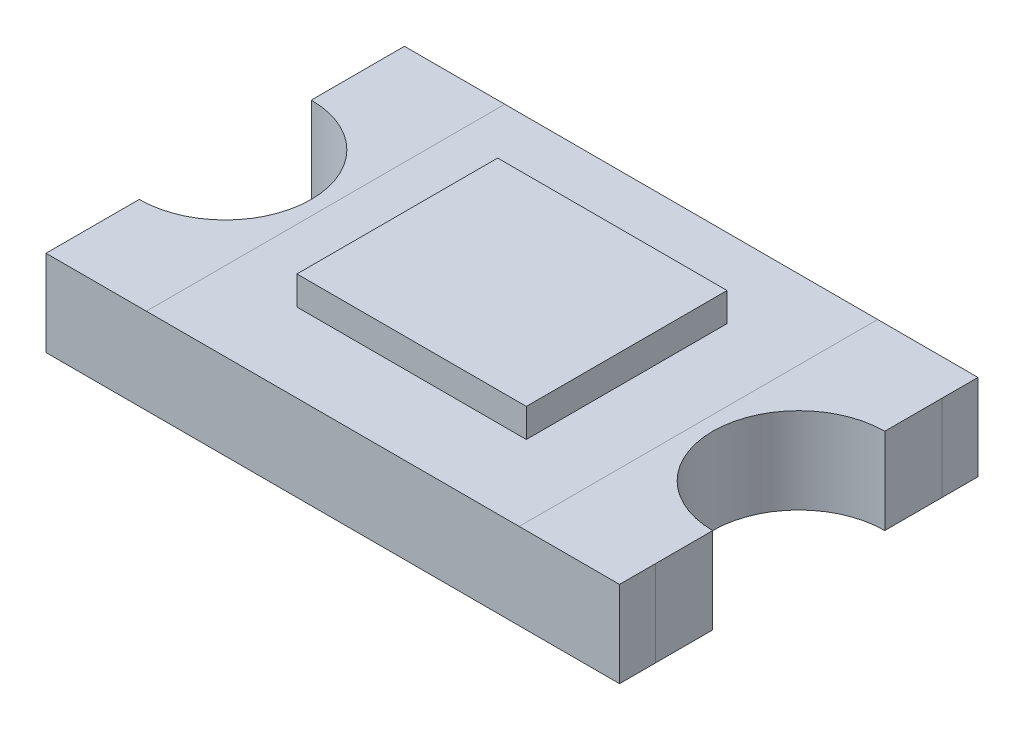
ISO-10303-21;
HEADER;
FILE_DESCRIPTION(('STEP AP214'),'2;1');
FILE_NAME('part.step','',(''),(''),'','','');
FILE_SCHEMA(('AUTOMOTIVE_DESIGN { 1 0 10303 214 1 1 1 1 }'));
ENDSEC;
DATA;
#1=APPLICATION_CONTEXT('core data for automotive mechanical design processes');
#2=APPLICATION_PROTOCOL_DEFINITION('international standard','automotive_design',2000,#1);
#3=PRODUCT_CONTEXT('',#1,'mechanical');
#4=PRODUCT('Part','Part','',(#3));
#5=PRODUCT_RELATED_PRODUCT_CATEGORY('part','',(#4));
#6=PRODUCT_DEFINITION_FORMATION('','',#4);
#7=PRODUCT_DEFINITION_CONTEXT('part definition',#1,'design');
#8=PRODUCT_DEFINITION('design','',#6,#7);
#9=PRODUCT_DEFINITION_SHAPE('','',#8);
#10=(LENGTH_UNIT() NAMED_UNIT(*) SI_UNIT(.MILLI.,.METRE.));
#11=(NAMED_UNIT(*) PLANE_ANGLE_UNIT() SI_UNIT($,.RADIAN.));
#12=(NAMED_UNIT(*) SI_UNIT($,.STERADIAN.) SOLID_ANGLE_UNIT());
#13=UNCERTAINTY_MEASURE_WITH_UNIT(LENGTH_MEASURE(1.E-05),#10,'distance_accuracy_value','');
#14=(GEOMETRIC_REPRESENTATION_CONTEXT(3) GLOBAL_UNCERTAINTY_ASSIGNED_CONTEXT((#13)) GLOBAL_UNIT_ASSIGNED_CONTEXT((#10,
#11,#12)) REPRESENTATION_CONTEXT('',''));
#15=CARTESIAN_POINT('',(0.,0.,0.));
#16=DIRECTION('',(0.,0.,1.));
#17=DIRECTION('',(1.,0.,0.));
#18=AXIS2_PLACEMENT_3D('',#15,#16,#17);
#19=CARTESIAN_POINT('',(1.,0.,0.));
#20=DIRECTION('',(0.,1.,0.));
#21=DIRECTION('',(1.,0.,0.));
#22=AXIS2_PLACEMENT_3D('',#19,#20,#21);
#23=PLANE('',#22);
#24=DIRECTION('',(0.,0.,1.));
#25=VECTOR('',#24,1.);
#26=CARTESIAN_POINT('',(-1.,0.,-0.3));
#27=LINE('',#26,#25);
#28=CARTESIAN_POINT('',(-1.,0.,-0.575));
#29=VERTEX_POINT('',#28);
#30=CARTESIAN_POINT('',(-1.,0.,-0.5));
#31=VERTEX_POINT('',#30);
#32=EDGE_CURVE('P0_E342',#29,#31,#27,.T.);
#33=ORIENTED_EDGE('',*,*,#32,.F.);
#34=DIRECTION('',(1.,0.,0.));
#35=VECTOR('',#34,1.);
#36=CARTESIAN_POINT('',(1.,0.,-0.575));
#37=LINE('',#36,#35);
#38=CARTESIAN_POINT('',(-0.6,0.,-0.575));
#39=VERTEX_POINT('',#38);
#40=EDGE_CURVE('P0_E319',#29,#39,#37,.T.);
#41=ORIENTED_EDGE('',*,*,#40,.T.);
#42=DIRECTION('',(0.,0.,1.));
#43=VECTOR('',#42,1.);
#44=CARTESIAN_POINT('',(-0.6,0.,0.));
#45=LINE('',#44,#43);
#46=CARTESIAN_POINT('',(-0.6,0.,0.575));
#47=VERTEX_POINT('',#46);
#48=EDGE_CURVE('P0_E311',#39,#47,#45,.T.);
#49=ORIENTED_EDGE('',*,*,#48,.T.);
#50=DIRECTION('',(-1.,0.,0.));
#51=VECTOR('',#50,1.);
#52=CARTESIAN_POINT('',(1.,0.,0.575));
#53=LINE('',#52,#51);
#54=CARTESIAN_POINT('',(-1.,0.,0.575));
#55=VERTEX_POINT('',#54);
#56=EDGE_CURVE('P0_E227',#47,#55,#53,.T.);
#57=ORIENTED_EDGE('',*,*,#56,.T.);
#58=DIRECTION('',(0.,0.,1.));
#59=VECTOR('',#58,1.);
#60=CARTESIAN_POINT('',(-1.,0.,0.625));
#61=LINE('',#60,#59);
#62=CARTESIAN_POINT('',(-1.,0.,0.5));
#63=VERTEX_POINT('',#62);
#64=EDGE_CURVE('P0_E243',#63,#55,#61,.T.);
#65=ORIENTED_EDGE('',*,*,#64,.F.);
#66=DIRECTION('',(0.,0.,1.));
#67=VECTOR('',#66,1.);
#68=CARTESIAN_POINT('',(-1.,0.,0.625));
#69=LINE('',#68,#67);
#70=CARTESIAN_POINT('',(-1.,0.,0.3));
#71=VERTEX_POINT('',#70);
#72=EDGE_CURVE('P0_E46',#71,#63,#69,.T.);
#73=ORIENTED_EDGE('',*,*,#72,.F.);
#74=CARTESIAN_POINT('',(-1.,0.,0.));
#75=DIRECTION('',(0.,-1.,0.));
#76=DIRECTION('',(0.,0.,1.));
#77=AXIS2_PLACEMENT_3D('',#74,#75,#76);
#78=CIRCLE('',#77,0.3);
#79=CARTESIAN_POINT('',(-1.,0.,-0.3));
#80=VERTEX_POINT('',#79);
#81=EDGE_CURVE('P0_E381',#80,#71,#78,.T.);
#82=ORIENTED_EDGE('',*,*,#81,.F.);
#83=DIRECTION('',(0.,0.,1.));
#84=VECTOR('',#83,1.);
#85=CARTESIAN_POINT('',(-1.,0.,-0.3));
#86=LINE('',#85,#84);
#87=EDGE_CURVE('P0_E440',#31,#80,#86,.T.);
#88=ORIENTED_EDGE('',*,*,#87,.F.);
#89=EDGE_LOOP('',(#33,#41,#49,#57,#65,#73,#82,#88));
#90=FACE_BOUND('',#89,.T.);
#91=ADVANCED_FACE('P0_F17',(#90),#23,.F.);
#92=CARTESIAN_POINT('',(1.,0.3,0.));
#93=DIRECTION('',(0.,1.,0.));
#94=DIRECTION('',(1.,0.,0.));
#95=AXIS2_PLACEMENT_3D('',#92,#93,#94);
#96=PLANE('',#95);
#97=DIRECTION('',(0.,0.,-1.));
#98=VECTOR('',#97,1.);
#99=CARTESIAN_POINT('',(0.65,0.3,0.));
#100=LINE('',#99,#98);
#101=CARTESIAN_POINT('',(0.65,0.3,0.625));
#102=VERTEX_POINT('',#101);
#103=CARTESIAN_POINT('',(0.65,0.3,-0.625));
#104=VERTEX_POINT('',#103);
#105=EDGE_CURVE('P0_E277',#102,#104,#100,.T.);
#106=ORIENTED_EDGE('',*,*,#105,.F.);
#107=DIRECTION('',(1.,0.,0.));
#108=VECTOR('',#107,1.);
#109=CARTESIAN_POINT('',(-1.,0.3,0.625));
#110=LINE('',#109,#108);
#111=CARTESIAN_POINT('',(1.,0.3,0.625));
#112=VERTEX_POINT('',#111);
#113=EDGE_CURVE('P0_E372',#102,#112,#110,.T.);
#114=ORIENTED_EDGE('',*,*,#113,.T.);
#115=DIRECTION('',(0.,0.,-1.));
#116=VECTOR('',#115,1.);
#117=CARTESIAN_POINT('',(1.,0.3,0.625));
#118=LINE('',#117,#116);
#119=CARTESIAN_POINT('',(1.,0.3,0.5));
#120=VERTEX_POINT('',#119);
#121=EDGE_CURVE('P0_E260',#112,#120,#118,.T.);
#122=ORIENTED_EDGE('',*,*,#121,.T.);
#123=DIRECTION('',(0.,0.,-1.));
#124=VECTOR('',#123,1.);
#125=CARTESIAN_POINT('',(1.,0.3,0.625));
#126=LINE('',#125,#124);
#127=CARTESIAN_POINT('',(1.,0.3,0.3));
#128=VERTEX_POINT('',#127);
#129=EDGE_CURVE('P0_E289',#120,#128,#126,.T.);
#130=ORIENTED_EDGE('',*,*,#129,.T.);
#131=CARTESIAN_POINT('',(1.,0.3,0.));
#132=DIRECTION('',(0.,-1.,0.));
#133=DIRECTION('',(0.,0.,1.));
#134=AXIS2_PLACEMENT_3D('',#131,#132,#133);
#135=CIRCLE('',#134,0.3);
#136=CARTESIAN_POINT('',(1.,0.3,-0.3));
#137=VERTEX_POINT('',#136);
#138=EDGE_CURVE('P0_E25',#128,#137,#135,.T.);
#139=ORIENTED_EDGE('',*,*,#138,.T.);
#140=DIRECTION('',(0.,0.,-1.));
#141=VECTOR('',#140,1.);
#142=CARTESIAN_POINT('',(1.,0.3,-0.3));
#143=LINE('',#142,#141);
#144=CARTESIAN_POINT('',(1.,0.3,-0.5));
#145=VERTEX_POINT('',#144);
#146=EDGE_CURVE('P0_E397',#137,#145,#143,.T.);
#147=ORIENTED_EDGE('',*,*,#146,.T.);
#148=DIRECTION('',(0.,0.,-1.));
#149=VECTOR('',#148,1.);
#150=CARTESIAN_POINT('',(1.,0.3,-0.3));
#151=LINE('',#150,#149);
#152=CARTESIAN_POINT('',(1.,0.3,-0.625));
#153=VERTEX_POINT('',#152);
#154=EDGE_CURVE('P0_E11',#145,#153,#151,.T.);
#155=ORIENTED_EDGE('',*,*,#154,.T.);
#156=DIRECTION('',(-1.,0.,0.));
#157=VECTOR('',#156,1.);
#158=CARTESIAN_POINT('',(-1.,0.3,-0.625));
#159=LINE('',#158,#157);
#160=EDGE_CURVE('P0_E343',#153,#104,#159,.T.);
#161=ORIENTED_EDGE('',*,*,#160,.T.);
#162=EDGE_LOOP('',(#106,#114,#122,#130,#139,#147,#155,#161));
#163=FACE_BOUND('',#162,.T.);
#164=ADVANCED_FACE('P0_F395',(#163),#96,.T.);
#165=CARTESIAN_POINT('',(1.,0.3,-0.3));
#166=DIRECTION('',(-1.,0.,0.));
#167=DIRECTION('',(0.,0.,1.));
#168=AXIS2_PLACEMENT_3D('',#165,#166,#167);
#169=PLANE('',#168);
#170=ORIENTED_EDGE('',*,*,#154,.F.);
#171=DIRECTION('',(0.,-1.,0.));
#172=VECTOR('',#171,1.);
#173=CARTESIAN_POINT('',(1.,0.3,-0.5));
#174=LINE('',#173,#172);
#175=CARTESIAN_POINT('',(1.,0.,-0.5));
#176=VERTEX_POINT('',#175);
#177=EDGE_CURVE('P0_E411',#145,#176,#174,.T.);
#178=ORIENTED_EDGE('',*,*,#177,.T.);
#179=DIRECTION('',(0.,0.,-1.));
#180=VECTOR('',#179,1.);
#181=CARTESIAN_POINT('',(1.,0.,-0.3));
#182=LINE('',#181,#180);
#183=CARTESIAN_POINT('',(1.,0.,-0.575));
#184=VERTEX_POINT('',#183);
#185=EDGE_CURVE('P0_E360',#176,#184,#182,.T.);
#186=ORIENTED_EDGE('',*,*,#185,.T.);
#187=DIRECTION('',(0.,0.,-1.));
#188=VECTOR('',#187,1.);
#189=CARTESIAN_POINT('',(1.,0.,-0.3));
#190=LINE('',#189,#188);
#191=CARTESIAN_POINT('',(1.,0.,-0.625));
#192=VERTEX_POINT('',#191);
#193=EDGE_CURVE('P0_E330',#184,#192,#190,.T.);
#194=ORIENTED_EDGE('',*,*,#193,.T.);
#195=DIRECTION('',(0.,-1.,0.));
#196=VECTOR('',#195,1.);
#197=CARTESIAN_POINT('',(1.,0.3,-0.625));
#198=LINE('',#197,#196);
#199=EDGE_CURVE('P0_E339',#153,#192,#198,.T.);
#200=ORIENTED_EDGE('',*,*,#199,.F.);
#201=EDGE_LOOP('',(#170,#178,#186,#194,#200));
#202=FACE_BOUND('',#201,.T.);
#203=ADVANCED_FACE('P0_F491',(#202),#169,.F.);
#204=CARTESIAN_POINT('',(1.,0.3,0.));
#205=DIRECTION('',(0.,-1.,0.));
#206=DIRECTION('',(0.,0.,-1.));
#207=AXIS2_PLACEMENT_3D('',#204,#205,#206);
#208=CYLINDRICAL_SURFACE('',#207,0.3);
#209=CARTESIAN_POINT('',(1.,0.,0.));
#210=DIRECTION('',(0.,-1.,0.));
#211=DIRECTION('',(0.,0.,1.));
#212=AXIS2_PLACEMENT_3D('',#209,#210,#211);
#213=CIRCLE('',#212,0.3);
#214=CARTESIAN_POINT('',(1.,0.,0.3));
#215=VERTEX_POINT('',#214);
#216=CARTESIAN_POINT('',(1.,0.,-0.3));
#217=VERTEX_POINT('',#216);
#218=EDGE_CURVE('P0_E367',#215,#217,#213,.T.);
#219=ORIENTED_EDGE('',*,*,#218,.T.);
#220=DIRECTION('',(0.,-1.,0.));
#221=VECTOR('',#220,1.);
#222=CARTESIAN_POINT('',(1.,0.3,-0.3));
#223=LINE('',#222,#221);
#224=EDGE_CURVE('P0_E400',#137,#217,#223,.T.);
#225=ORIENTED_EDGE('',*,*,#224,.F.);
#226=ORIENTED_EDGE('',*,*,#138,.F.);
#227=DIRECTION('',(0.,-1.,0.));
#228=VECTOR('',#227,1.);
#229=CARTESIAN_POINT('',(1.,0.3,0.3));
#230=LINE('',#229,#228);
#231=EDGE_CURVE('P0_E286',#128,#215,#230,.T.);
#232=ORIENTED_EDGE('',*,*,#231,.T.);
#233=EDGE_LOOP('',(#219,#225,#226,#232));
#234=FACE_BOUND('',#233,.T.);
#235=ADVANCED_FACE('P0_F401',(#234),#208,.F.);
#236=CARTESIAN_POINT('',(1.,0.3,0.625));
#237=DIRECTION('',(-1.,0.,0.));
#238=DIRECTION('',(0.,0.,1.));
#239=AXIS2_PLACEMENT_3D('',#236,#237,#238);
#240=PLANE('',#239);
#241=ORIENTED_EDGE('',*,*,#129,.F.);
#242=DIRECTION('',(0.,-1.,0.));
#243=VECTOR('',#242,1.);
#244=CARTESIAN_POINT('',(1.,0.3,0.5));
#245=LINE('',#244,#243);
#246=CARTESIAN_POINT('',(1.,0.,0.5));
#247=VERTEX_POINT('',#246);
#248=EDGE_CURVE('P0_E256',#120,#247,#245,.T.);
#249=ORIENTED_EDGE('',*,*,#248,.T.);
#250=DIRECTION('',(0.,0.,-1.));
#251=VECTOR('',#250,1.);
#252=CARTESIAN_POINT('',(1.,0.,0.625));
#253=LINE('',#252,#251);
#254=EDGE_CURVE('P0_E364',#247,#215,#253,.T.);
#255=ORIENTED_EDGE('',*,*,#254,.T.);
#256=ORIENTED_EDGE('',*,*,#231,.F.);
#257=EDGE_LOOP('',(#241,#249,#255,#256));
#258=FACE_BOUND('',#257,.T.);
#259=ADVANCED_FACE('P0_F503',(#258),#240,.F.);
#260=CARTESIAN_POINT('',(-1.,0.3,0.625));
#261=DIRECTION('',(0.,0.,-1.));
#262=DIRECTION('',(0.,-1.,0.));
#263=AXIS2_PLACEMENT_3D('',#260,#261,#262);
#264=PLANE('',#263);
#265=DIRECTION('',(1.,0.,0.));
#266=VECTOR('',#265,1.);
#267=CARTESIAN_POINT('',(-1.,0.,0.625));
#268=LINE('',#267,#266);
#269=CARTESIAN_POINT('',(-1.,0.,0.625));
#270=VERTEX_POINT('',#269);
#271=CARTESIAN_POINT('',(1.,0.,0.625));
#272=VERTEX_POINT('',#271);
#273=EDGE_CURVE('P0_E214',#270,#272,#268,.T.);
#274=ORIENTED_EDGE('',*,*,#273,.T.);
#275=DIRECTION('',(0.,-1.,0.));
#276=VECTOR('',#275,1.);
#277=CARTESIAN_POINT('',(1.,0.3,0.625));
#278=LINE('',#277,#276);
#279=EDGE_CURVE('P0_E263',#112,#272,#278,.T.);
#280=ORIENTED_EDGE('',*,*,#279,.F.);
#281=ORIENTED_EDGE('',*,*,#113,.F.);
#282=DIRECTION('',(1.,0.,0.));
#283=VECTOR('',#282,1.);
#284=CARTESIAN_POINT('',(-1.,0.3,0.625));
#285=LINE('',#284,#283);
#286=CARTESIAN_POINT('',(-0.65,0.3,0.625));
#287=VERTEX_POINT('',#286);
#288=EDGE_CURVE('P0_E273',#287,#102,#285,.T.);
#289=ORIENTED_EDGE('',*,*,#288,.F.);
#290=DIRECTION('',(1.,0.,0.));
#291=VECTOR('',#290,1.);
#292=CARTESIAN_POINT('',(-1.,0.3,0.625));
#293=LINE('',#292,#291);
#294=CARTESIAN_POINT('',(-1.,0.3,0.625));
#295=VERTEX_POINT('',#294);
#296=EDGE_CURVE('P0_E234',#295,#287,#293,.T.);
#297=ORIENTED_EDGE('',*,*,#296,.F.);
#298=DIRECTION('',(0.,-1.,0.));
#299=VECTOR('',#298,1.);
#300=CARTESIAN_POINT('',(-1.,0.3,0.625));
#301=LINE('',#300,#299);
#302=EDGE_CURVE('P0_E231',#295,#270,#301,.T.);
#303=ORIENTED_EDGE('',*,*,#302,.T.);
#304=EDGE_LOOP('',(#274,#280,#281,#289,#297,#303));
#305=FACE_BOUND('',#304,.T.);
#306=ADVANCED_FACE('P0_F232',(#305),#264,.F.);
#307=CARTESIAN_POINT('',(-1.,0.3,0.625));
#308=DIRECTION('',(1.,0.,0.));
#309=DIRECTION('',(0.,1.,0.));
#310=AXIS2_PLACEMENT_3D('',#307,#308,#309);
#311=PLANE('',#310);
#312=ORIENTED_EDGE('',*,*,#72,.T.);
#313=DIRECTION('',(0.,1.,0.));
#314=VECTOR('',#313,1.);
#315=CARTESIAN_POINT('',(-1.,0.3,0.5));
#316=LINE('',#315,#314);
#317=CARTESIAN_POINT('',(-1.,0.3,0.5));
#318=VERTEX_POINT('',#317);
#319=EDGE_CURVE('P0_E250',#63,#318,#316,.T.);
#320=ORIENTED_EDGE('',*,*,#319,.T.);
#321=DIRECTION('',(0.,0.,1.));
#322=VECTOR('',#321,1.);
#323=CARTESIAN_POINT('',(-1.,0.3,0.625));
#324=LINE('',#323,#322);
#325=CARTESIAN_POINT('',(-1.,0.3,0.3));
#326=VERTEX_POINT('',#325);
#327=EDGE_CURVE('P0_E303',#326,#318,#324,.T.);
#328=ORIENTED_EDGE('',*,*,#327,.F.);
#329=DIRECTION('',(0.,-1.,0.));
#330=VECTOR('',#329,1.);
#331=CARTESIAN_POINT('',(-1.,0.3,0.3));
#332=LINE('',#331,#330);
#333=EDGE_CURVE('P0_E373',#326,#71,#332,.T.);
#334=ORIENTED_EDGE('',*,*,#333,.T.);
#335=EDGE_LOOP('',(#312,#320,#328,#334));
#336=FACE_BOUND('',#335,.T.);
#337=ADVANCED_FACE('P0_F471',(#336),#311,.F.);
#338=CARTESIAN_POINT('',(-1.,0.3,0.));
#339=DIRECTION('',(0.,-1.,0.));
#340=DIRECTION('',(0.,0.,-1.));
#341=AXIS2_PLACEMENT_3D('',#338,#339,#340);
#342=CYLINDRICAL_SURFACE('',#341,0.3);
#343=ORIENTED_EDGE('',*,*,#81,.T.);
#344=ORIENTED_EDGE('',*,*,#333,.F.);
#345=CARTESIAN_POINT('',(-1.,0.3,0.));
#346=DIRECTION('',(0.,-1.,0.));
#347=DIRECTION('',(0.,0.,1.));
#348=AXIS2_PLACEMENT_3D('',#345,#346,#347);
#349=CIRCLE('',#348,0.3);
#350=CARTESIAN_POINT('',(-1.,0.3,-0.3));
#351=VERTEX_POINT('',#350);
#352=EDGE_CURVE('P0_E299',#351,#326,#349,.T.);
#353=ORIENTED_EDGE('',*,*,#352,.F.);
#354=DIRECTION('',(0.,-1.,0.));
#355=VECTOR('',#354,1.);
#356=CARTESIAN_POINT('',(-1.,0.3,-0.3));
#357=LINE('',#356,#355);
#358=EDGE_CURVE('P0_E441',#351,#80,#357,.T.);
#359=ORIENTED_EDGE('',*,*,#358,.T.);
#360=EDGE_LOOP('',(#343,#344,#353,#359));
#361=FACE_BOUND('',#360,.T.);
#362=ADVANCED_FACE('P0_F468',(#361),#342,.F.);
#363=CARTESIAN_POINT('',(-1.,0.3,-0.3));
#364=DIRECTION('',(1.,0.,0.));
#365=DIRECTION('',(0.,1.,0.));
#366=AXIS2_PLACEMENT_3D('',#363,#364,#365);
#367=PLANE('',#366);
#368=ORIENTED_EDGE('',*,*,#32,.T.);
#369=DIRECTION('',(0.,1.,0.));
#370=VECTOR('',#369,1.);
#371=CARTESIAN_POINT('',(-1.,0.3,-0.5));
#372=LINE('',#371,#370);
#373=CARTESIAN_POINT('',(-1.,0.3,-0.5));
#374=VERTEX_POINT('',#373);
#375=EDGE_CURVE('P0_E436',#31,#374,#372,.T.);
#376=ORIENTED_EDGE('',*,*,#375,.T.);
#377=DIRECTION('',(0.,0.,1.));
#378=VECTOR('',#377,1.);
#379=CARTESIAN_POINT('',(-1.,0.3,-0.3));
#380=LINE('',#379,#378);
#381=CARTESIAN_POINT('',(-1.,0.3,-0.625));
#382=VERTEX_POINT('',#381);
#383=EDGE_CURVE('P0_E296',#382,#374,#380,.T.);
#384=ORIENTED_EDGE('',*,*,#383,.F.);
#385=DIRECTION('',(0.,-1.,0.));
#386=VECTOR('',#385,1.);
#387=CARTESIAN_POINT('',(-1.,0.3,-0.625));
#388=LINE('',#387,#386);
#389=CARTESIAN_POINT('',(-1.,0.,-0.625));
#390=VERTEX_POINT('',#389);
#391=EDGE_CURVE('P0_E361',#382,#390,#388,.T.);
#392=ORIENTED_EDGE('',*,*,#391,.T.);
#393=DIRECTION('',(0.,0.,1.));
#394=VECTOR('',#393,1.);
#395=CARTESIAN_POINT('',(-1.,0.,-0.3));
#396=LINE('',#395,#394);
#397=EDGE_CURVE('P0_E322',#390,#29,#396,.T.);
#398=ORIENTED_EDGE('',*,*,#397,.T.);
#399=EDGE_LOOP('',(#368,#376,#384,#392,#398));
#400=FACE_BOUND('',#399,.T.);
#401=ADVANCED_FACE('P0_F484',(#400),#367,.F.);
#402=CARTESIAN_POINT('',(-1.,0.3,-0.625));
#403=DIRECTION('',(0.,0.,1.));
#404=DIRECTION('',(1.,0.,0.));
#405=AXIS2_PLACEMENT_3D('',#402,#403,#404);
#406=PLANE('',#405);
#407=DIRECTION('',(-1.,0.,0.));
#408=VECTOR('',#407,1.);
#409=CARTESIAN_POINT('',(-1.,0.,-0.625));
#410=LINE('',#409,#408);
#411=EDGE_CURVE('P0_E326',#192,#390,#410,.T.);
#412=ORIENTED_EDGE('',*,*,#411,.T.);
#413=ORIENTED_EDGE('',*,*,#391,.F.);
#414=DIRECTION('',(-1.,0.,0.));
#415=VECTOR('',#414,1.);
#416=CARTESIAN_POINT('',(-1.,0.3,-0.625));
#417=LINE('',#416,#415);
#418=CARTESIAN_POINT('',(-0.65,0.3,-0.625));
#419=VERTEX_POINT('',#418);
#420=EDGE_CURVE('P0_E292',#419,#382,#417,.T.);
#421=ORIENTED_EDGE('',*,*,#420,.F.);
#422=DIRECTION('',(-1.,0.,0.));
#423=VECTOR('',#422,1.);
#424=CARTESIAN_POINT('',(-1.,0.3,-0.625));
#425=LINE('',#424,#423);
#426=EDGE_CURVE('P0_E281',#104,#419,#425,.T.);
#427=ORIENTED_EDGE('',*,*,#426,.F.);
#428=ORIENTED_EDGE('',*,*,#160,.F.);
#429=ORIENTED_EDGE('',*,*,#199,.T.);
#430=EDGE_LOOP('',(#412,#413,#421,#427,#428,#429));
#431=FACE_BOUND('',#430,.T.);
#432=ADVANCED_FACE('P0_F480',(#431),#406,.F.);
#433=CARTESIAN_POINT('',(1.,0.,0.));
#434=DIRECTION('',(0.,1.,0.));
#435=DIRECTION('',(1.,0.,0.));
#436=AXIS2_PLACEMENT_3D('',#433,#434,#435);
#437=PLANE('',#436);
#438=DIRECTION('',(0.,0.,-1.));
#439=VECTOR('',#438,1.);
#440=CARTESIAN_POINT('',(1.,0.,0.625));
#441=LINE('',#440,#439);
#442=CARTESIAN_POINT('',(1.,0.,0.575));
#443=VERTEX_POINT('',#442);
#444=EDGE_CURVE('P0_E269',#443,#247,#441,.T.);
#445=ORIENTED_EDGE('',*,*,#444,.F.);
#446=DIRECTION('',(-1.,0.,0.));
#447=VECTOR('',#446,1.);
#448=CARTESIAN_POINT('',(1.,0.,0.575));
#449=LINE('',#448,#447);
#450=CARTESIAN_POINT('',(0.6,0.,0.575));
#451=VERTEX_POINT('',#450);
#452=EDGE_CURVE('P0_E228',#443,#451,#449,.T.);
#453=ORIENTED_EDGE('',*,*,#452,.T.);
#454=DIRECTION('',(0.,0.,-1.));
#455=VECTOR('',#454,1.);
#456=CARTESIAN_POINT('',(0.6,0.,0.));
#457=LINE('',#456,#455);
#458=CARTESIAN_POINT('',(0.6,0.,-0.575));
#459=VERTEX_POINT('',#458);
#460=EDGE_CURVE('P0_E338',#451,#459,#457,.T.);
#461=ORIENTED_EDGE('',*,*,#460,.T.);
#462=DIRECTION('',(1.,0.,0.));
#463=VECTOR('',#462,1.);
#464=CARTESIAN_POINT('',(1.,0.,-0.575));
#465=LINE('',#464,#463);
#466=EDGE_CURVE('P0_E334',#459,#184,#465,.T.);
#467=ORIENTED_EDGE('',*,*,#466,.T.);
#468=ORIENTED_EDGE('',*,*,#185,.F.);
#469=DIRECTION('',(0.,0.,-1.));
#470=VECTOR('',#469,1.);
#471=CARTESIAN_POINT('',(1.,0.,-0.3));
#472=LINE('',#471,#470);
#473=EDGE_CURVE('P0_E407',#217,#176,#472,.T.);
#474=ORIENTED_EDGE('',*,*,#473,.F.);
#475=ORIENTED_EDGE('',*,*,#218,.F.);
#476=ORIENTED_EDGE('',*,*,#254,.F.);
#477=EDGE_LOOP('',(#445,#453,#461,#467,#468,#474,#475,#476));
#478=FACE_BOUND('',#477,.T.);
#479=ADVANCED_FACE('P0_F509',(#478),#437,.F.);
#480=CARTESIAN_POINT('',(1.,0.,0.));
#481=DIRECTION('',(0.,1.,0.));
#482=DIRECTION('',(1.,0.,0.));
#483=AXIS2_PLACEMENT_3D('',#480,#481,#482);
#484=PLANE('',#483);
#485=DIRECTION('',(0.,0.,1.));
#486=VECTOR('',#485,1.);
#487=CARTESIAN_POINT('',(-0.0375,0.,0.));
#488=LINE('',#487,#486);
#489=CARTESIAN_POINT('',(-0.0375,0.,0.0625));
#490=VERTEX_POINT('',#489);
#491=CARTESIAN_POINT('',(-0.0375,0.,0.525));
#492=VERTEX_POINT('',#491);
#493=EDGE_CURVE('P0_E350',#490,#492,#488,.T.);
#494=ORIENTED_EDGE('',*,*,#493,.T.);
#495=DIRECTION('',(-1.,0.,0.));
#496=VECTOR('',#495,1.);
#497=CARTESIAN_POINT('',(1.,0.,0.525));
#498=LINE('',#497,#496);
#499=CARTESIAN_POINT('',(-0.1625,0.,0.525));
#500=VERTEX_POINT('',#499);
#501=EDGE_CURVE('P0_E346',#492,#500,#498,.T.);
#502=ORIENTED_EDGE('',*,*,#501,.T.);
#503=DIRECTION('',(0.,0.,-1.));
#504=VECTOR('',#503,1.);
#505=CARTESIAN_POINT('',(-0.1625,0.,0.));
#506=LINE('',#505,#504);
#507=CARTESIAN_POINT('',(-0.1625,0.,-0.525));
#508=VERTEX_POINT('',#507);
#509=EDGE_CURVE('P0_E315',#500,#508,#506,.T.);
#510=ORIENTED_EDGE('',*,*,#509,.T.);
#511=DIRECTION('',(1.,0.,0.));
#512=VECTOR('',#511,1.);
#513=CARTESIAN_POINT('',(1.,0.,-0.525));
#514=LINE('',#513,#512);
#515=CARTESIAN_POINT('',(-0.0375,0.,-0.525));
#516=VERTEX_POINT('',#515);
#517=EDGE_CURVE('P0_E312',#508,#516,#514,.T.);
#518=ORIENTED_EDGE('',*,*,#517,.T.);
#519=DIRECTION('',(0.,0.,1.));
#520=VECTOR('',#519,1.);
#521=CARTESIAN_POINT('',(-0.0375,0.,0.));
#522=LINE('',#521,#520);
#523=CARTESIAN_POINT('',(-0.0375,0.,-0.0625));
#524=VERTEX_POINT('',#523);
#525=EDGE_CURVE('P0_E316',#516,#524,#522,.T.);
#526=ORIENTED_EDGE('',*,*,#525,.T.);
#527=DIRECTION('',(1.,0.,0.));
#528=VECTOR('',#527,1.);
#529=CARTESIAN_POINT('',(1.,0.,-0.0625));
#530=LINE('',#529,#528);
#531=CARTESIAN_POINT('',(0.1625,0.,-0.0625));
#532=VERTEX_POINT('',#531);
#533=EDGE_CURVE('P0_E357',#524,#532,#530,.T.);
#534=ORIENTED_EDGE('',*,*,#533,.T.);
#535=DIRECTION('',(0.,0.,1.));
#536=VECTOR('',#535,1.);
#537=CARTESIAN_POINT('',(0.1625,0.,0.));
#538=LINE('',#537,#536);
#539=CARTESIAN_POINT('',(0.1625,0.,0.0625));
#540=VERTEX_POINT('',#539);
#541=EDGE_CURVE('P0_E354',#532,#540,#538,.T.);
#542=ORIENTED_EDGE('',*,*,#541,.T.);
#543=DIRECTION('',(-1.,0.,0.));
#544=VECTOR('',#543,1.);
#545=CARTESIAN_POINT('',(1.,0.,0.0625));
#546=LINE('',#545,#544);
#547=EDGE_CURVE('P0_E351',#540,#490,#546,.T.);
#548=ORIENTED_EDGE('',*,*,#547,.T.);
#549=EDGE_LOOP('',(#494,#502,#510,#518,#526,#534,#542,#548));
#550=FACE_BOUND('',#549,.T.);
#551=ADVANCED_FACE('P0_F514',(#550),#484,.F.);
#552=CARTESIAN_POINT('',(1.,0.,0.));
#553=DIRECTION('',(0.,1.,0.));
#554=DIRECTION('',(1.,0.,0.));
#555=AXIS2_PLACEMENT_3D('',#552,#553,#554);
#556=PLANE('',#555);
#557=ORIENTED_EDGE('',*,*,#501,.F.);
#558=ORIENTED_EDGE('',*,*,#493,.F.);
#559=ORIENTED_EDGE('',*,*,#547,.F.);
#560=ORIENTED_EDGE('',*,*,#541,.F.);
#561=ORIENTED_EDGE('',*,*,#533,.F.);
#562=ORIENTED_EDGE('',*,*,#525,.F.);
#563=ORIENTED_EDGE('',*,*,#517,.F.);
#564=ORIENTED_EDGE('',*,*,#509,.F.);
#565=EDGE_LOOP('',(#557,#558,#559,#560,#561,#562,#563,#564));
#566=FACE_BOUND('',#565,.T.);
#567=ORIENTED_EDGE('',*,*,#452,.F.);
#568=DIRECTION('',(0.,0.,-1.));
#569=VECTOR('',#568,1.);
#570=CARTESIAN_POINT('',(1.,0.,0.625));
#571=LINE('',#570,#569);
#572=EDGE_CURVE('P0_E222',#272,#443,#571,.T.);
#573=ORIENTED_EDGE('',*,*,#572,.F.);
#574=ORIENTED_EDGE('',*,*,#273,.F.);
#575=DIRECTION('',(0.,0.,1.));
#576=VECTOR('',#575,1.);
#577=CARTESIAN_POINT('',(-1.,0.,0.625));
#578=LINE('',#577,#576);
#579=EDGE_CURVE('P0_E219',#55,#270,#578,.T.);
#580=ORIENTED_EDGE('',*,*,#579,.F.);
#581=ORIENTED_EDGE('',*,*,#56,.F.);
#582=ORIENTED_EDGE('',*,*,#48,.F.);
#583=ORIENTED_EDGE('',*,*,#40,.F.);
#584=ORIENTED_EDGE('',*,*,#397,.F.);
#585=ORIENTED_EDGE('',*,*,#411,.F.);
#586=ORIENTED_EDGE('',*,*,#193,.F.);
#587=ORIENTED_EDGE('',*,*,#466,.F.);
#588=ORIENTED_EDGE('',*,*,#460,.F.);
#589=EDGE_LOOP('',(#567,#573,#574,#580,#581,#582,#583,#584,#585,#586,#587,#588));
#590=FACE_BOUND('',#589,.T.);
#591=ADVANCED_FACE('P0_F216',(#566,#590),#556,.F.);
#592=CARTESIAN_POINT('',(1.,0.3,0.));
#593=DIRECTION('',(0.,1.,0.));
#594=DIRECTION('',(1.,0.,0.));
#595=AXIS2_PLACEMENT_3D('',#592,#593,#594);
#596=PLANE('',#595);
#597=ORIENTED_EDGE('',*,*,#296,.T.);
#598=DIRECTION('',(0.,0.,-1.));
#599=VECTOR('',#598,1.);
#600=CARTESIAN_POINT('',(-0.65,0.3,0.));
#601=LINE('',#600,#599);
#602=EDGE_CURVE('P0_E282',#287,#419,#601,.T.);
#603=ORIENTED_EDGE('',*,*,#602,.T.);
#604=ORIENTED_EDGE('',*,*,#420,.T.);
#605=ORIENTED_EDGE('',*,*,#383,.T.);
#606=DIRECTION('',(0.,0.,1.));
#607=VECTOR('',#606,1.);
#608=CARTESIAN_POINT('',(-1.,0.3,-0.3));
#609=LINE('',#608,#607);
#610=EDGE_CURVE('P0_E417',#374,#351,#609,.T.);
#611=ORIENTED_EDGE('',*,*,#610,.T.);
#612=ORIENTED_EDGE('',*,*,#352,.T.);
#613=ORIENTED_EDGE('',*,*,#327,.T.);
#614=DIRECTION('',(0.,0.,1.));
#615=VECTOR('',#614,1.);
#616=CARTESIAN_POINT('',(-1.,0.3,0.625));
#617=LINE('',#616,#615);
#618=EDGE_CURVE('P0_E239',#318,#295,#617,.T.);
#619=ORIENTED_EDGE('',*,*,#618,.T.);
#620=EDGE_LOOP('',(#597,#603,#604,#605,#611,#612,#613,#619));
#621=FACE_BOUND('',#620,.T.);
#622=ADVANCED_FACE('P0_F461',(#621),#596,.T.);
#623=CARTESIAN_POINT('',(1.,0.3,0.));
#624=DIRECTION('',(0.,1.,0.));
#625=DIRECTION('',(1.,0.,0.));
#626=AXIS2_PLACEMENT_3D('',#623,#624,#625);
#627=PLANE('',#626);
#628=ORIENTED_EDGE('',*,*,#288,.T.);
#629=ORIENTED_EDGE('',*,*,#105,.T.);
#630=ORIENTED_EDGE('',*,*,#426,.T.);
#631=ORIENTED_EDGE('',*,*,#602,.F.);
#632=EDGE_LOOP('',(#628,#629,#630,#631));
#633=FACE_BOUND('',#632,.T.);
#634=ADVANCED_FACE('P0_F474',(#633),#627,.T.);
#635=CARTESIAN_POINT('',(1.,0.3,0.625));
#636=DIRECTION('',(-1.,0.,0.));
#637=DIRECTION('',(0.,0.,1.));
#638=AXIS2_PLACEMENT_3D('',#635,#636,#637);
#639=PLANE('',#638);
#640=ORIENTED_EDGE('',*,*,#248,.F.);
#641=ORIENTED_EDGE('',*,*,#121,.F.);
#642=ORIENTED_EDGE('',*,*,#279,.T.);
#643=ORIENTED_EDGE('',*,*,#572,.T.);
#644=ORIENTED_EDGE('',*,*,#444,.T.);
#645=EDGE_LOOP('',(#640,#641,#642,#643,#644));
#646=FACE_BOUND('',#645,.T.);
#647=ADVANCED_FACE('P0_F526',(#646),#639,.F.);
#648=CARTESIAN_POINT('',(-1.,0.3,0.625));
#649=DIRECTION('',(1.,0.,0.));
#650=DIRECTION('',(0.,1.,0.));
#651=AXIS2_PLACEMENT_3D('',#648,#649,#650);
#652=PLANE('',#651);
#653=ORIENTED_EDGE('',*,*,#319,.F.);
#654=ORIENTED_EDGE('',*,*,#64,.T.);
#655=ORIENTED_EDGE('',*,*,#579,.T.);
#656=ORIENTED_EDGE('',*,*,#302,.F.);
#657=ORIENTED_EDGE('',*,*,#618,.F.);
#658=EDGE_LOOP('',(#653,#654,#655,#656,#657));
#659=FACE_BOUND('',#658,.T.);
#660=ADVANCED_FACE('P0_F242',(#659),#652,.F.);
#661=CARTESIAN_POINT('',(1.,0.3,-0.3));
#662=DIRECTION('',(-1.,0.,0.));
#663=DIRECTION('',(0.,0.,1.));
#664=AXIS2_PLACEMENT_3D('',#661,#662,#663);
#665=PLANE('',#664);
#666=ORIENTED_EDGE('',*,*,#177,.F.);
#667=ORIENTED_EDGE('',*,*,#146,.F.);
#668=ORIENTED_EDGE('',*,*,#224,.T.);
#669=ORIENTED_EDGE('',*,*,#473,.T.);
#670=EDGE_LOOP('',(#666,#667,#668,#669));
#671=FACE_BOUND('',#670,.T.);
#672=ADVANCED_FACE('P0_F409',(#671),#665,.F.);
#673=CARTESIAN_POINT('',(-1.,0.3,-0.3));
#674=DIRECTION('',(1.,0.,0.));
#675=DIRECTION('',(0.,1.,0.));
#676=AXIS2_PLACEMENT_3D('',#673,#674,#675);
#677=PLANE('',#676);
#678=ORIENTED_EDGE('',*,*,#375,.F.);
#679=ORIENTED_EDGE('',*,*,#87,.T.);
#680=ORIENTED_EDGE('',*,*,#358,.F.);
#681=ORIENTED_EDGE('',*,*,#610,.F.);
#682=EDGE_LOOP('',(#678,#679,#680,#681));
#683=FACE_BOUND('',#682,.T.);
#684=ADVANCED_FACE('P0_F465',(#683),#677,.F.);
#685=CLOSED_SHELL('',(#91,#164,#203,#235,#259,#306,#337,#362,#401,#432,#479,#551,#591,#622,#634,
#647,#660,#672,#684));
#686=MANIFOLD_SOLID_BREP('P0_B1',#685);
#687=CARTESIAN_POINT('',(0.,0.3,0.));
#688=DIRECTION('',(0.,-1.,0.));
#689=DIRECTION('',(0.,0.,-1.));
#690=AXIS2_PLACEMENT_3D('',#687,#688,#689);
#691=PLANE('',#690);
#692=DIRECTION('',(0.,0.,-1.));
#693=VECTOR('',#692,1.);
#694=CARTESIAN_POINT('',(0.4,0.3,0.35));
#695=LINE('',#694,#693);
#696=CARTESIAN_POINT('',(0.4,0.3,0.35));
#697=VERTEX_POINT('',#696);
#698=CARTESIAN_POINT('',(0.4,0.3,-0.35));
#699=VERTEX_POINT('',#698);
#700=EDGE_CURVE('P1_E80',#697,#699,#695,.T.);
#701=ORIENTED_EDGE('',*,*,#700,.F.);
#702=DIRECTION('',(1.,0.,0.));
#703=VECTOR('',#702,1.);
#704=CARTESIAN_POINT('',(-0.4,0.3,0.35));
#705=LINE('',#704,#703);
#706=CARTESIAN_POINT('',(-0.4,0.3,0.35));
#707=VERTEX_POINT('',#706);
#708=EDGE_CURVE('P1_E25',#707,#697,#705,.T.);
#709=ORIENTED_EDGE('',*,*,#708,.F.);
#710=DIRECTION('',(0.,0.,1.));
#711=VECTOR('',#710,1.);
#712=CARTESIAN_POINT('',(-0.4,0.3,0.35));
#713=LINE('',#712,#711);
#714=CARTESIAN_POINT('',(-0.4,0.3,-0.35));
#715=VERTEX_POINT('',#714);
#716=EDGE_CURVE('P1_E99',#715,#707,#713,.T.);
#717=ORIENTED_EDGE('',*,*,#716,.F.);
#718=DIRECTION('',(-1.,0.,0.));
#719=VECTOR('',#718,1.);
#720=CARTESIAN_POINT('',(-0.4,0.3,-0.35));
#721=LINE('',#720,#719);
#722=EDGE_CURVE('P1_E84',#699,#715,#721,.T.);
#723=ORIENTED_EDGE('',*,*,#722,.F.);
#724=EDGE_LOOP('',(#701,#709,#717,#723));
#725=FACE_BOUND('',#724,.T.);
#726=ADVANCED_FACE('P1_F17',(#725),#691,.T.);
#727=CARTESIAN_POINT('',(0.,0.4,0.));
#728=DIRECTION('',(0.,-1.,0.));
#729=DIRECTION('',(0.,0.,-1.));
#730=AXIS2_PLACEMENT_3D('',#727,#728,#729);
#731=PLANE('',#730);
#732=DIRECTION('',(0.,0.,-1.));
#733=VECTOR('',#732,1.);
#734=CARTESIAN_POINT('',(0.4,0.4,0.35));
#735=LINE('',#734,#733);
#736=CARTESIAN_POINT('',(0.4,0.4,0.35));
#737=VERTEX_POINT('',#736);
#738=CARTESIAN_POINT('',(0.4,0.4,-0.35));
#739=VERTEX_POINT('',#738);
#740=EDGE_CURVE('P1_E82',#737,#739,#735,.T.);
#741=ORIENTED_EDGE('',*,*,#740,.T.);
#742=DIRECTION('',(-1.,0.,0.));
#743=VECTOR('',#742,1.);
#744=CARTESIAN_POINT('',(-0.4,0.4,-0.35));
#745=LINE('',#744,#743);
#746=CARTESIAN_POINT('',(-0.4,0.4,-0.35));
#747=VERTEX_POINT('',#746);
#748=EDGE_CURVE('P1_E102',#739,#747,#745,.T.);
#749=ORIENTED_EDGE('',*,*,#748,.T.);
#750=DIRECTION('',(0.,0.,1.));
#751=VECTOR('',#750,1.);
#752=CARTESIAN_POINT('',(-0.4,0.4,0.35));
#753=LINE('',#752,#751);
#754=CARTESIAN_POINT('',(-0.4,0.4,0.35));
#755=VERTEX_POINT('',#754);
#756=EDGE_CURVE('P1_E74',#747,#755,#753,.T.);
#757=ORIENTED_EDGE('',*,*,#756,.T.);
#758=DIRECTION('',(1.,0.,0.));
#759=VECTOR('',#758,1.);
#760=CARTESIAN_POINT('',(-0.4,0.4,0.35));
#761=LINE('',#760,#759);
#762=EDGE_CURVE('P1_E11',#755,#737,#761,.T.);
#763=ORIENTED_EDGE('',*,*,#762,.T.);
#764=EDGE_LOOP('',(#741,#749,#757,#763));
#765=FACE_BOUND('',#764,.T.);
#766=ADVANCED_FACE('P1_F122',(#765),#731,.F.);
#767=CARTESIAN_POINT('',(-0.4,0.4,0.35));
#768=DIRECTION('',(0.,0.,-1.));
#769=DIRECTION('',(0.,-1.,0.));
#770=AXIS2_PLACEMENT_3D('',#767,#768,#769);
#771=PLANE('',#770);
#772=ORIENTED_EDGE('',*,*,#708,.T.);
#773=DIRECTION('',(0.,-1.,0.));
#774=VECTOR('',#773,1.);
#775=CARTESIAN_POINT('',(0.4,0.4,0.35));
#776=LINE('',#775,#774);
#777=EDGE_CURVE('P1_E68',#737,#697,#776,.T.);
#778=ORIENTED_EDGE('',*,*,#777,.F.);
#779=ORIENTED_EDGE('',*,*,#762,.F.);
#780=DIRECTION('',(0.,-1.,0.));
#781=VECTOR('',#780,1.);
#782=CARTESIAN_POINT('',(-0.4,0.4,0.35));
#783=LINE('',#782,#781);
#784=EDGE_CURVE('P1_E71',#755,#707,#783,.T.);
#785=ORIENTED_EDGE('',*,*,#784,.T.);
#786=EDGE_LOOP('',(#772,#778,#779,#785));
#787=FACE_BOUND('',#786,.T.);
#788=ADVANCED_FACE('P1_F67',(#787),#771,.F.);
#789=CARTESIAN_POINT('',(-0.4,0.4,0.35));
#790=DIRECTION('',(1.,0.,0.));
#791=DIRECTION('',(0.,1.,0.));
#792=AXIS2_PLACEMENT_3D('',#789,#790,#791);
#793=PLANE('',#792);
#794=ORIENTED_EDGE('',*,*,#716,.T.);
#795=ORIENTED_EDGE('',*,*,#784,.F.);
#796=ORIENTED_EDGE('',*,*,#756,.F.);
#797=DIRECTION('',(0.,-1.,0.));
#798=VECTOR('',#797,1.);
#799=CARTESIAN_POINT('',(-0.4,0.4,-0.35));
#800=LINE('',#799,#798);
#801=EDGE_CURVE('P1_E105',#747,#715,#800,.T.);
#802=ORIENTED_EDGE('',*,*,#801,.T.);
#803=EDGE_LOOP('',(#794,#795,#796,#802));
#804=FACE_BOUND('',#803,.T.);
#805=ADVANCED_FACE('P1_F117',(#804),#793,.F.);
#806=CARTESIAN_POINT('',(-0.4,0.4,-0.35));
#807=DIRECTION('',(0.,0.,1.));
#808=DIRECTION('',(1.,0.,0.));
#809=AXIS2_PLACEMENT_3D('',#806,#807,#808);
#810=PLANE('',#809);
#811=ORIENTED_EDGE('',*,*,#722,.T.);
#812=ORIENTED_EDGE('',*,*,#801,.F.);
#813=ORIENTED_EDGE('',*,*,#748,.F.);
#814=DIRECTION('',(0.,-1.,0.));
#815=VECTOR('',#814,1.);
#816=CARTESIAN_POINT('',(0.4,0.4,-0.35));
#817=LINE('',#816,#815);
#818=EDGE_CURVE('P1_E89',#739,#699,#817,.T.);
#819=ORIENTED_EDGE('',*,*,#818,.T.);
#820=EDGE_LOOP('',(#811,#812,#813,#819));
#821=FACE_BOUND('',#820,.T.);
#822=ADVANCED_FACE('P1_F120',(#821),#810,.F.);
#823=CARTESIAN_POINT('',(0.4,0.4,0.35));
#824=DIRECTION('',(-1.,0.,0.));
#825=DIRECTION('',(0.,0.,1.));
#826=AXIS2_PLACEMENT_3D('',#823,#824,#825);
#827=PLANE('',#826);
#828=ORIENTED_EDGE('',*,*,#700,.T.);
#829=ORIENTED_EDGE('',*,*,#818,.F.);
#830=ORIENTED_EDGE('',*,*,#740,.F.);
#831=ORIENTED_EDGE('',*,*,#777,.T.);
#832=EDGE_LOOP('',(#828,#829,#830,#831));
#833=FACE_BOUND('',#832,.T.);
#834=ADVANCED_FACE('P1_F78',(#833),#827,.F.);
#835=CLOSED_SHELL('',(#726,#766,#788,#805,#822,#834));
#836=MANIFOLD_SOLID_BREP('P1_B1',#835);
#837=ADVANCED_BREP_SHAPE_REPRESENTATION('',(#18,#686,#836),#14);
#838=SHAPE_DEFINITION_REPRESENTATION(#9,#837);
ENDSEC;
END-ISO-10303-21;
